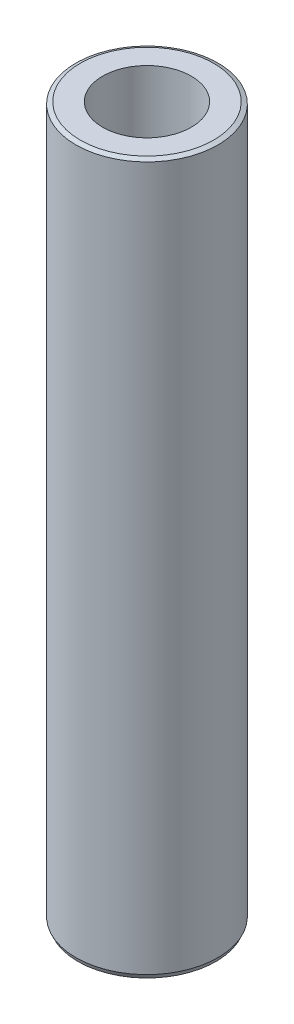
ISO-10303-21;
HEADER;
FILE_DESCRIPTION(('STEP AP214'),'2;1');
FILE_NAME('part.step','',(''),(''),'','','');
FILE_SCHEMA(('AUTOMOTIVE_DESIGN { 1 0 10303 214 1 1 1 1 }'));
ENDSEC;
DATA;
#1=APPLICATION_CONTEXT('core data for automotive mechanical design processes');
#2=APPLICATION_PROTOCOL_DEFINITION('international standard','automotive_design',2000,#1);
#3=PRODUCT_CONTEXT('',#1,'mechanical');
#4=PRODUCT('Part','Part','',(#3));
#5=PRODUCT_RELATED_PRODUCT_CATEGORY('part','',(#4));
#6=PRODUCT_DEFINITION_FORMATION('','',#4);
#7=PRODUCT_DEFINITION_CONTEXT('part definition',#1,'design');
#8=PRODUCT_DEFINITION('design','',#6,#7);
#9=PRODUCT_DEFINITION_SHAPE('','',#8);
#10=(LENGTH_UNIT() NAMED_UNIT(*) SI_UNIT(.MILLI.,.METRE.));
#11=(NAMED_UNIT(*) PLANE_ANGLE_UNIT() SI_UNIT($,.RADIAN.));
#12=(NAMED_UNIT(*) SI_UNIT($,.STERADIAN.) SOLID_ANGLE_UNIT());
#13=UNCERTAINTY_MEASURE_WITH_UNIT(LENGTH_MEASURE(1.E-05),#10,'distance_accuracy_value','');
#14=(GEOMETRIC_REPRESENTATION_CONTEXT(3) GLOBAL_UNCERTAINTY_ASSIGNED_CONTEXT((#13)) GLOBAL_UNIT_ASSIGNED_CONTEXT((#10,
#11,#12)) REPRESENTATION_CONTEXT('',''));
#15=CARTESIAN_POINT('',(0.,0.,0.));
#16=DIRECTION('',(0.,0.,1.));
#17=DIRECTION('',(1.,0.,0.));
#18=AXIS2_PLACEMENT_3D('',#15,#16,#17);
#19=CARTESIAN_POINT('',(0.,600.,0.));
#20=DIRECTION('',(0.,-1.,0.));
#21=DIRECTION('',(0.,0.,-1.));
#22=AXIS2_PLACEMENT_3D('',#19,#20,#21);
#23=CYLINDRICAL_SURFACE('',#22,60.);
#24=CARTESIAN_POINT('',(0.,598.323795436565,0.));
#25=DIRECTION('',(0.,1.,0.));
#26=DIRECTION('',(0.,0.,1.));
#27=AXIS2_PLACEMENT_3D('',#24,#25,#26);
#28=CIRCLE('',#27,60.);
#29=CARTESIAN_POINT('',(0.,598.323795436565,60.));
#30=VERTEX_POINT('',#29);
#31=EDGE_CURVE('E50',#30,#30,#28,.F.);
#32=ORIENTED_EDGE('',*,*,#31,.T.);
#33=EDGE_LOOP('',(#32));
#34=FACE_BOUND('',#33,.T.);
#35=CARTESIAN_POINT('',(0.,3.67882137729392,0.));
#36=DIRECTION('',(0.,1.,0.));
#37=DIRECTION('',(0.,0.,1.));
#38=AXIS2_PLACEMENT_3D('',#35,#36,#37);
#39=CIRCLE('',#38,60.);
#40=CARTESIAN_POINT('',(0.,3.67882137729392,60.));
#41=VERTEX_POINT('',#40);
#42=EDGE_CURVE('E51',#41,#41,#39,.T.);
#43=ORIENTED_EDGE('',*,*,#42,.T.);
#44=EDGE_LOOP('',(#43));
#45=FACE_BOUND('',#44,.T.);
#46=ADVANCED_FACE('F39',(#34,#45),#23,.T.);
#47=CARTESIAN_POINT('',(0.,600.,0.));
#48=DIRECTION('',(0.,1.,0.));
#49=DIRECTION('',(0.,0.,1.));
#50=AXIS2_PLACEMENT_3D('',#47,#48,#49);
#51=PLANE('',#50);
#52=CARTESIAN_POINT('',(0.,600.,0.));
#53=DIRECTION('',(0.,1.,0.));
#54=DIRECTION('',(0.,0.,1.));
#55=AXIS2_PLACEMENT_3D('',#52,#53,#54);
#56=CIRCLE('',#55,56.3211786227063);
#57=CARTESIAN_POINT('',(0.,600.,56.3211786227063));
#58=VERTEX_POINT('',#57);
#59=EDGE_CURVE('E54',#58,#58,#56,.T.);
#60=ORIENTED_EDGE('',*,*,#59,.T.);
#61=EDGE_LOOP('',(#60));
#62=FACE_BOUND('',#61,.T.);
#63=CARTESIAN_POINT('',(0.,600.,0.));
#64=DIRECTION('',(0.,1.,0.));
#65=DIRECTION('',(0.,0.,1.));
#66=AXIS2_PLACEMENT_3D('',#63,#64,#65);
#67=CIRCLE('',#66,37.4490044280927);
#68=CARTESIAN_POINT('',(0.,600.,37.4490044280927));
#69=VERTEX_POINT('',#68);
#70=EDGE_CURVE('E58',#69,#69,#67,.T.);
#71=ORIENTED_EDGE('',*,*,#70,.F.);
#72=EDGE_LOOP('',(#71));
#73=FACE_BOUND('',#72,.T.);
#74=ADVANCED_FACE('F69',(#62,#73),#51,.T.);
#75=CARTESIAN_POINT('',(0.,0.,0.));
#76=DIRECTION('',(0.,1.,0.));
#77=DIRECTION('',(0.,0.,1.));
#78=AXIS2_PLACEMENT_3D('',#75,#76,#77);
#79=PLANE('',#78);
#80=CARTESIAN_POINT('',(0.,0.,0.));
#81=DIRECTION('',(0.,1.,0.));
#82=DIRECTION('',(0.,0.,1.));
#83=AXIS2_PLACEMENT_3D('',#80,#81,#82);
#84=CIRCLE('',#83,58.3237954365653);
#85=CARTESIAN_POINT('',(0.,0.,58.3237954365653));
#86=VERTEX_POINT('',#85);
#87=EDGE_CURVE('E10',#86,#86,#84,.F.);
#88=ORIENTED_EDGE('',*,*,#87,.T.);
#89=EDGE_LOOP('',(#88));
#90=FACE_BOUND('',#89,.T.);
#91=CARTESIAN_POINT('',(0.,0.,0.));
#92=DIRECTION('',(0.,1.,0.));
#93=DIRECTION('',(0.,0.,1.));
#94=AXIS2_PLACEMENT_3D('',#91,#92,#93);
#95=CIRCLE('',#94,37.4490044280927);
#96=CARTESIAN_POINT('',(0.,0.,37.4490044280927));
#97=VERTEX_POINT('',#96);
#98=EDGE_CURVE('E63',#97,#97,#95,.T.);
#99=ORIENTED_EDGE('',*,*,#98,.T.);
#100=EDGE_LOOP('',(#99));
#101=FACE_BOUND('',#100,.T.);
#102=ADVANCED_FACE('F75',(#90,#101),#79,.F.);
#103=CARTESIAN_POINT('',(0.,600.,0.));
#104=DIRECTION('',(0.,-1.,0.));
#105=DIRECTION('',(0.,0.,-1.));
#106=AXIS2_PLACEMENT_3D('',#103,#104,#105);
#107=CYLINDRICAL_SURFACE('',#106,37.4490044280927);
#108=ORIENTED_EDGE('',*,*,#70,.T.);
#109=EDGE_LOOP('',(#108));
#110=FACE_BOUND('',#109,.T.);
#111=ORIENTED_EDGE('',*,*,#98,.F.);
#112=EDGE_LOOP('',(#111));
#113=FACE_BOUND('',#112,.T.);
#114=ADVANCED_FACE('F70',(#110,#113),#107,.F.);
#115=CARTESIAN_POINT('',(0.,600.,0.));
#116=DIRECTION('',(0.,-1.,0.));
#117=DIRECTION('',(0.,0.,-1.));
#118=AXIS2_PLACEMENT_3D('',#115,#116,#117);
#119=CONICAL_SURFACE('',#118,56.3211786227063,1.14326514780755);
#120=ORIENTED_EDGE('',*,*,#31,.F.);
#121=EDGE_LOOP('',(#120));
#122=FACE_BOUND('',#121,.T.);
#123=ORIENTED_EDGE('',*,*,#59,.F.);
#124=EDGE_LOOP('',(#123));
#125=FACE_BOUND('',#124,.T.);
#126=ADVANCED_FACE('F81',(#122,#125),#119,.T.);
#127=CARTESIAN_POINT('',(0.,3.67882137729392,0.));
#128=DIRECTION('',(0.,1.,0.));
#129=DIRECTION('',(0.,0.,1.));
#130=AXIS2_PLACEMENT_3D('',#127,#128,#129);
#131=CONICAL_SURFACE('',#130,60.,0.427531178987322);
#132=CARTESIAN_POINT('',(0.,0.,58.3237954365653));
#133=CARTESIAN_POINT('',(0.,0.038321056013478,58.3412559007678));
#134=CARTESIAN_POINT('',(0.,0.0766421120269563,58.3587163649702));
#135=CARTESIAN_POINT('',(0.,0.153284224053913,58.3936372933751));
#136=CARTESIAN_POINT('',(0.,0.191605280067391,58.4110977575775));
#137=CARTESIAN_POINT('',(0.,0.268247392094348,58.4460186859824));
#138=CARTESIAN_POINT('',(0.,0.306568448107827,58.4634791501849));
#139=CARTESIAN_POINT('',(0.,0.383210560134783,58.4984000785898));
#140=CARTESIAN_POINT('',(0.,0.421531616148261,58.5158605427922));
#141=CARTESIAN_POINT('',(0.,0.498173728175217,58.5507814711971));
#142=CARTESIAN_POINT('',(0.,0.536494784188696,58.5682419353995));
#143=CARTESIAN_POINT('',(0.,0.613136896215653,58.6031628638044));
#144=CARTESIAN_POINT('',(0.,0.651457952229131,58.6206233280069));
#145=CARTESIAN_POINT('',(0.,0.728100064256087,58.6555442564118));
#146=CARTESIAN_POINT('',(0.,0.766421120269566,58.6730047206142));
#147=CARTESIAN_POINT('',(0.,0.843063232296522,58.7079256490191));
#148=CARTESIAN_POINT('',(0.,0.881384288310001,58.7253861132215));
#149=CARTESIAN_POINT('',(0.,0.958026400336957,58.7603070416264));
#150=CARTESIAN_POINT('',(0.,0.996347456350435,58.7777675058289));
#151=CARTESIAN_POINT('',(0.,1.07298956837739,58.8126884342338));
#152=CARTESIAN_POINT('',(0.,1.11131062439087,58.8301488984362));
#153=CARTESIAN_POINT('',(0.,1.18795273641783,58.8650698268411));
#154=CARTESIAN_POINT('',(0.,1.2262737924313,58.8825302910435));
#155=CARTESIAN_POINT('',(0.,1.30291590445826,58.9174512194484));
#156=CARTESIAN_POINT('',(0.,1.34123696047174,58.9349116836509));
#157=CARTESIAN_POINT('',(0.,1.4178790724987,58.9698326120558));
#158=CARTESIAN_POINT('',(0.,1.45620012851218,58.9872930762582));
#159=CARTESIAN_POINT('',(0.,1.53284224053913,59.0222140046631));
#160=CARTESIAN_POINT('',(0.,1.57116329655261,59.0396744688655));
#161=CARTESIAN_POINT('',(0.,1.64780540857957,59.0745953972704));
#162=CARTESIAN_POINT('',(0.,1.68612646459305,59.0920558614729));
#163=CARTESIAN_POINT('',(0.,1.76276857662,59.1269767898778));
#164=CARTESIAN_POINT('',(0.,1.80108963263348,59.1444372540802));
#165=CARTESIAN_POINT('',(0.,1.87773174466044,59.1793581824851));
#166=CARTESIAN_POINT('',(0.,1.91605280067391,59.1968186466875));
#167=CARTESIAN_POINT('',(0.,1.99269491270087,59.2317395750924));
#168=CARTESIAN_POINT('',(0.,2.03101596871435,59.2492000392949));
#169=CARTESIAN_POINT('',(0.,2.10765808074131,59.2841209676998));
#170=CARTESIAN_POINT('',(0.,2.14597913675478,59.3015814319022));
#171=CARTESIAN_POINT('',(0.,2.22262124878174,59.3365023603071));
#172=CARTESIAN_POINT('',(0.,2.26094230479522,59.3539628245095));
#173=CARTESIAN_POINT('',(0.,2.33758441682218,59.3888837529144));
#174=CARTESIAN_POINT('',(0.,2.37590547283565,59.4063442171169));
#175=CARTESIAN_POINT('',(0.,2.45254758486261,59.4412651455218));
#176=CARTESIAN_POINT('',(0.,2.49086864087609,59.4587256097242));
#177=CARTESIAN_POINT('',(0.,2.56751075290305,59.4936465381291));
#178=CARTESIAN_POINT('',(0.,2.60583180891652,59.5111070023315));
#179=CARTESIAN_POINT('',(0.,2.68247392094348,59.5460279307364));
#180=CARTESIAN_POINT('',(0.,2.72079497695696,59.5634883949389));
#181=CARTESIAN_POINT('',(0.,2.79743708898392,59.5984093233438));
#182=CARTESIAN_POINT('',(0.,2.83575814499739,59.6158697875462));
#183=CARTESIAN_POINT('',(0.,2.91240025702435,59.6507907159511));
#184=CARTESIAN_POINT('',(0.,2.95072131303783,59.6682511801535));
#185=CARTESIAN_POINT('',(0.,3.02736342506479,59.7031721085584));
#186=CARTESIAN_POINT('',(0.,3.06568448107826,59.7206325727609));
#187=CARTESIAN_POINT('',(0.,3.14232659310522,59.7555535011658));
#188=CARTESIAN_POINT('',(0.,3.1806476491187,59.7730139653682));
#189=CARTESIAN_POINT('',(0.,3.25728976114566,59.8079348937731));
#190=CARTESIAN_POINT('',(0.,3.29561081715913,59.8253953579756));
#191=CARTESIAN_POINT('',(0.,3.37225292918609,59.8603162863804));
#192=CARTESIAN_POINT('',(0.,3.41057398519957,59.8777767505829));
#193=CARTESIAN_POINT('',(0.,3.48721609722653,59.9126976789878));
#194=CARTESIAN_POINT('',(0.,3.52553715324,59.9301581431902));
#195=CARTESIAN_POINT('',(0.,3.60217926526696,59.9650790715951));
#196=CARTESIAN_POINT('',(0.,3.64050032128044,59.9825395357976));
#197=CARTESIAN_POINT('',(0.,3.67882137729392,60.));
#198=B_SPLINE_CURVE_WITH_KNOTS('',3,(#132,#133,#134,#135,#136,#137,#138,#139,#140,#141,#142,
#143,#144,#145,#146,#147,#148,#149,#150,#151,#152,#153,#154,#155,#156,#157,#158,#159,#160,#161,
#162,#163,#164,#165,#166,#167,#168,#169,#170,#171,#172,#173,#174,#175,#176,#177,#178,#179,#180,
#181,#182,#183,#184,#185,#186,#187,#188,#189,#190,#191,#192,#193,#194,#195,#196,#197),
.UNSPECIFIED.,.F.,.F.,(4,2,2,2,2,2,2,2,2,2,2,2,2,2,2,2,2,2,2,2,2,2,2,2,2,2,2,2,2,2,2,2,4),(0.,
0.12633424039973,0.25266848079946,0.37900272119919,0.505336961598923,0.631671201998654,
0.758005442398384,0.884339682798114,1.01067392319784,1.13700816359757,1.2633424039973,
1.38967664439704,1.51601088479677,1.6423451251965,1.76867936559623,1.89501360599596,
2.02134784639569,2.14768208679542,2.27401632719515,2.40035056759488,2.52668480799461,
2.65301904839434,2.77935328879407,2.90568752919381,3.03202176959354,3.15835600999327,
3.284690250393,3.41102449079273,3.53735873119246,3.66369297159219,3.79002721199192,
3.91636145239165,4.04269569279138),.UNSPECIFIED.);
#199=EDGE_CURVE('BSEAM45',#86,#41,#198,.T.);
#200=ORIENTED_EDGE('',*,*,#87,.F.);
#201=ORIENTED_EDGE('',*,*,#42,.F.);
#202=ORIENTED_EDGE('',*,*,#199,.T.);
#203=ORIENTED_EDGE('',*,*,#199,.F.);
#204=EDGE_LOOP('',(#200,#202,#201,#203));
#205=FACE_BOUND('',#204,.T.);
#206=ADVANCED_FACE('F45',(#205),#131,.T.);
#207=CLOSED_SHELL('',(#46,#74,#102,#114,#126,#206));
#208=MANIFOLD_SOLID_BREP('B2',#207);
#209=ADVANCED_BREP_SHAPE_REPRESENTATION('',(#18,#208),#14);
#210=SHAPE_DEFINITION_REPRESENTATION(#9,#209);
ENDSEC;
END-ISO-10303-21;
